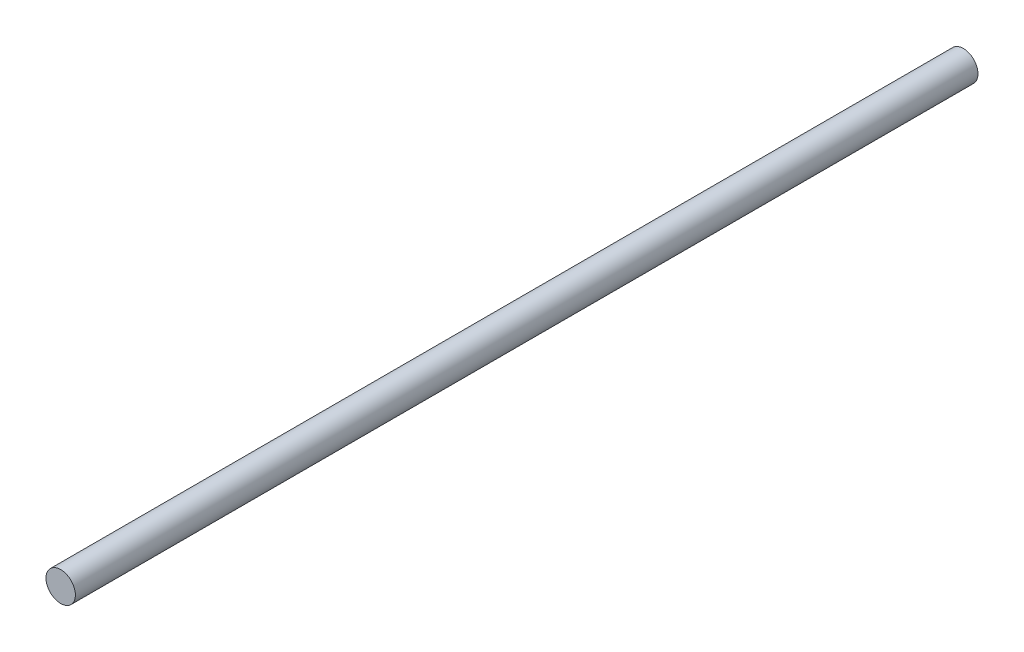
ISO-10303-21;
HEADER;
FILE_DESCRIPTION(('STEP AP214'),'2;1');
FILE_NAME('part.step','',(''),(''),'','','');
FILE_SCHEMA(('AUTOMOTIVE_DESIGN { 1 0 10303 214 1 1 1 1 }'));
ENDSEC;
DATA;
#1=APPLICATION_CONTEXT('core data for automotive mechanical design processes');
#2=APPLICATION_PROTOCOL_DEFINITION('international standard','automotive_design',2000,#1);
#3=PRODUCT_CONTEXT('',#1,'mechanical');
#4=PRODUCT('Part','Part','',(#3));
#5=PRODUCT_RELATED_PRODUCT_CATEGORY('part','',(#4));
#6=PRODUCT_DEFINITION_FORMATION('','',#4);
#7=PRODUCT_DEFINITION_CONTEXT('part definition',#1,'design');
#8=PRODUCT_DEFINITION('design','',#6,#7);
#9=PRODUCT_DEFINITION_SHAPE('','',#8);
#10=(LENGTH_UNIT() NAMED_UNIT(*) SI_UNIT(.MILLI.,.METRE.));
#11=(NAMED_UNIT(*) PLANE_ANGLE_UNIT() SI_UNIT($,.RADIAN.));
#12=(NAMED_UNIT(*) SI_UNIT($,.STERADIAN.) SOLID_ANGLE_UNIT());
#13=UNCERTAINTY_MEASURE_WITH_UNIT(LENGTH_MEASURE(1.E-05),#10,'distance_accuracy_value','');
#14=(GEOMETRIC_REPRESENTATION_CONTEXT(3) GLOBAL_UNCERTAINTY_ASSIGNED_CONTEXT((#13)) GLOBAL_UNIT_ASSIGNED_CONTEXT((#10,
#11,#12)) REPRESENTATION_CONTEXT('',''));
#15=CARTESIAN_POINT('',(0.,0.,0.));
#16=DIRECTION('',(0.,0.,1.));
#17=DIRECTION('',(1.,0.,0.));
#18=AXIS2_PLACEMENT_3D('',#15,#16,#17);
#19=CARTESIAN_POINT('',(0.,0.,181.));
#20=DIRECTION('',(0.,0.,-1.));
#21=DIRECTION('',(-1.,0.,0.));
#22=AXIS2_PLACEMENT_3D('',#19,#20,#21);
#23=CYLINDRICAL_SURFACE('',#22,2.95);
#24=CARTESIAN_POINT('',(0.,0.,181.));
#25=DIRECTION('',(0.,0.,1.));
#26=DIRECTION('',(1.,0.,0.));
#27=AXIS2_PLACEMENT_3D('',#24,#25,#26);
#28=CIRCLE('',#27,2.95);
#29=CARTESIAN_POINT('',(2.95,0.,181.));
#30=VERTEX_POINT('',#29);
#31=EDGE_CURVE('E10',#30,#30,#28,.T.);
#32=ORIENTED_EDGE('',*,*,#31,.F.);
#33=EDGE_LOOP('',(#32));
#34=FACE_BOUND('',#33,.T.);
#35=CARTESIAN_POINT('',(0.,0.,0.));
#36=DIRECTION('',(0.,0.,1.));
#37=DIRECTION('',(1.,0.,0.));
#38=AXIS2_PLACEMENT_3D('',#35,#36,#37);
#39=CIRCLE('',#38,2.95);
#40=CARTESIAN_POINT('',(2.95,0.,0.));
#41=VERTEX_POINT('',#40);
#42=EDGE_CURVE('E40',#41,#41,#39,.T.);
#43=ORIENTED_EDGE('',*,*,#42,.T.);
#44=EDGE_LOOP('',(#43));
#45=FACE_BOUND('',#44,.T.);
#46=ADVANCED_FACE('F37',(#34,#45),#23,.T.);
#47=CARTESIAN_POINT('',(0.,0.,181.));
#48=DIRECTION('',(0.,0.,1.));
#49=DIRECTION('',(1.,0.,0.));
#50=AXIS2_PLACEMENT_3D('',#47,#48,#49);
#51=PLANE('',#50);
#52=ORIENTED_EDGE('',*,*,#31,.T.);
#53=EDGE_LOOP('',(#52));
#54=FACE_BOUND('',#53,.T.);
#55=ADVANCED_FACE('F54',(#54),#51,.T.);
#56=CARTESIAN_POINT('',(0.,0.,0.));
#57=DIRECTION('',(0.,0.,1.));
#58=DIRECTION('',(1.,0.,0.));
#59=AXIS2_PLACEMENT_3D('',#56,#57,#58);
#60=PLANE('',#59);
#61=ORIENTED_EDGE('',*,*,#42,.F.);
#62=EDGE_LOOP('',(#61));
#63=FACE_BOUND('',#62,.T.);
#64=ADVANCED_FACE('F52',(#63),#60,.F.);
#65=CLOSED_SHELL('',(#46,#55,#64));
#66=MANIFOLD_SOLID_BREP('B2',#65);
#67=ADVANCED_BREP_SHAPE_REPRESENTATION('',(#18,#66),#14);
#68=SHAPE_DEFINITION_REPRESENTATION(#9,#67);
ENDSEC;
END-ISO-10303-21;
